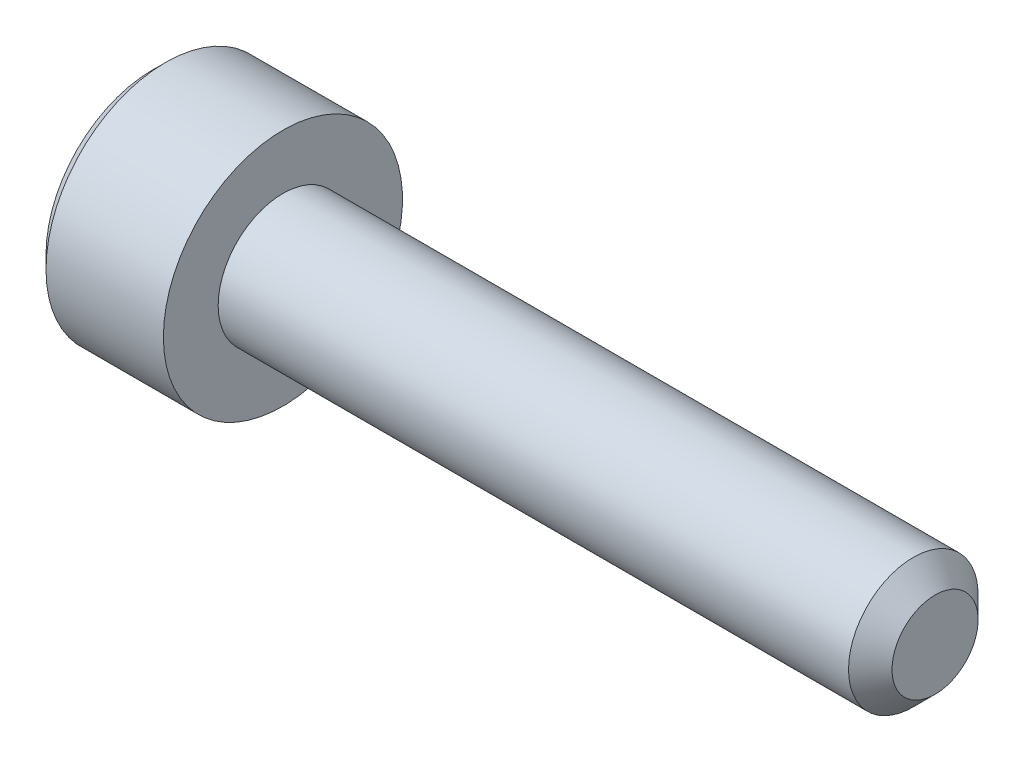
ISO-10303-21;
HEADER;
FILE_DESCRIPTION(('STEP AP214'),'2;1');
FILE_NAME('part.step','',(''),(''),'','','');
FILE_SCHEMA(('AUTOMOTIVE_DESIGN { 1 0 10303 214 1 1 1 1 }'));
ENDSEC;
DATA;
#1=APPLICATION_CONTEXT('core data for automotive mechanical design processes');
#2=APPLICATION_PROTOCOL_DEFINITION('international standard','automotive_design',2000,#1);
#3=PRODUCT_CONTEXT('',#1,'mechanical');
#4=PRODUCT('Part','Part','',(#3));
#5=PRODUCT_RELATED_PRODUCT_CATEGORY('part','',(#4));
#6=PRODUCT_DEFINITION_FORMATION('','',#4);
#7=PRODUCT_DEFINITION_CONTEXT('part definition',#1,'design');
#8=PRODUCT_DEFINITION('design','',#6,#7);
#9=PRODUCT_DEFINITION_SHAPE('','',#8);
#10=(LENGTH_UNIT() NAMED_UNIT(*) SI_UNIT(.MILLI.,.METRE.));
#11=(NAMED_UNIT(*) PLANE_ANGLE_UNIT() SI_UNIT($,.RADIAN.));
#12=(NAMED_UNIT(*) SI_UNIT($,.STERADIAN.) SOLID_ANGLE_UNIT());
#13=UNCERTAINTY_MEASURE_WITH_UNIT(LENGTH_MEASURE(1.E-05),#10,'distance_accuracy_value','');
#14=(GEOMETRIC_REPRESENTATION_CONTEXT(3) GLOBAL_UNCERTAINTY_ASSIGNED_CONTEXT((#13)) GLOBAL_UNIT_ASSIGNED_CONTEXT((#10,
#11,#12)) REPRESENTATION_CONTEXT('',''));
#15=CARTESIAN_POINT('',(0.,0.,0.));
#16=DIRECTION('',(0.,0.,1.));
#17=DIRECTION('',(1.,0.,0.));
#18=AXIS2_PLACEMENT_3D('',#15,#16,#17);
#19=CARTESIAN_POINT('',(0.,0.,0.));
#20=DIRECTION('',(1.,0.,0.));
#21=DIRECTION('',(0.,0.,-1.));
#22=AXIS2_PLACEMENT_3D('',#19,#20,#21);
#23=PLANE('',#22);
#24=DIRECTION('',(0.,0.866025403784439,0.5));
#25=VECTOR('',#24,1.);
#26=CARTESIAN_POINT('',(0.,1.4,-0.981495457622362));
#27=LINE('',#26,#25);
#28=CARTESIAN_POINT('',(0.,0.,-1.78978583448784));
#29=VERTEX_POINT('',#28);
#30=CARTESIAN_POINT('',(0.,1.55,-0.894892917243918));
#31=VERTEX_POINT('',#30);
#32=EDGE_CURVE('E171',#29,#31,#27,.T.);
#33=ORIENTED_EDGE('',*,*,#32,.T.);
#34=DIRECTION('',(0.,0.,1.));
#35=VECTOR('',#34,1.);
#36=CARTESIAN_POINT('',(0.,1.55,0.721687836487032));
#37=LINE('',#36,#35);
#38=CARTESIAN_POINT('',(0.,1.55,0.894892917243919));
#39=VERTEX_POINT('',#38);
#40=EDGE_CURVE('E186',#31,#39,#37,.T.);
#41=ORIENTED_EDGE('',*,*,#40,.T.);
#42=DIRECTION('',(0.,-0.866025403784439,0.5));
#43=VECTOR('',#42,1.);
#44=CARTESIAN_POINT('',(0.,0.15,1.7031832941094));
#45=LINE('',#44,#43);
#46=CARTESIAN_POINT('',(0.,0.,1.78978583448784));
#47=VERTEX_POINT('',#46);
#48=EDGE_CURVE('E183',#39,#47,#45,.T.);
#49=ORIENTED_EDGE('',*,*,#48,.T.);
#50=DIRECTION('',(0.,-0.866025403784439,-0.5));
#51=VECTOR('',#50,1.);
#52=CARTESIAN_POINT('',(0.,-1.4,0.981495457622364));
#53=LINE('',#52,#51);
#54=CARTESIAN_POINT('',(0.,-1.55,0.89489291724392));
#55=VERTEX_POINT('',#54);
#56=EDGE_CURVE('E180',#47,#55,#53,.T.);
#57=ORIENTED_EDGE('',*,*,#56,.T.);
#58=DIRECTION('',(0.,0.,-1.));
#59=VECTOR('',#58,1.);
#60=CARTESIAN_POINT('',(0.,-1.55,-0.721687836487031));
#61=LINE('',#60,#59);
#62=CARTESIAN_POINT('',(0.,-1.55,-0.894892917243919));
#63=VERTEX_POINT('',#62);
#64=EDGE_CURVE('E177',#55,#63,#61,.T.);
#65=ORIENTED_EDGE('',*,*,#64,.T.);
#66=DIRECTION('',(0.,0.866025403784439,-0.5));
#67=VECTOR('',#66,1.);
#68=CARTESIAN_POINT('',(0.,-0.149999999999999,-1.7031832941094));
#69=LINE('',#68,#67);
#70=EDGE_CURVE('E174',#63,#29,#69,.T.);
#71=ORIENTED_EDGE('',*,*,#70,.T.);
#72=EDGE_LOOP('',(#33,#41,#49,#57,#65,#71));
#73=FACE_BOUND('',#72,.T.);
#74=CARTESIAN_POINT('',(0.,0.,0.));
#75=DIRECTION('',(1.,0.,0.));
#76=DIRECTION('',(0.,0.,-1.));
#77=AXIS2_PLACEMENT_3D('',#74,#75,#76);
#78=CIRCLE('',#77,2.45);
#79=CARTESIAN_POINT('',(0.,0.,-2.45));
#80=VERTEX_POINT('',#79);
#81=EDGE_CURVE('E163',#80,#80,#78,.F.);
#82=ORIENTED_EDGE('',*,*,#81,.T.);
#83=EDGE_LOOP('',(#82));
#84=FACE_BOUND('',#83,.T.);
#85=ADVANCED_FACE('F39',(#73,#84),#23,.F.);
#86=CARTESIAN_POINT('',(18.,0.,0.));
#87=DIRECTION('',(-1.,0.,0.));
#88=DIRECTION('',(0.,0.,1.));
#89=AXIS2_PLACEMENT_3D('',#86,#87,#88);
#90=PLANE('',#89);
#91=CARTESIAN_POINT('',(18.,0.,0.));
#92=DIRECTION('',(-1.,0.,0.));
#93=DIRECTION('',(0.,0.,1.));
#94=AXIS2_PLACEMENT_3D('',#91,#92,#93);
#95=CIRCLE('',#94,0.990000000000003);
#96=CARTESIAN_POINT('',(18.,0.,0.990000000000003));
#97=VERTEX_POINT('',#96);
#98=EDGE_CURVE('E159',#97,#97,#95,.F.);
#99=ORIENTED_EDGE('',*,*,#98,.T.);
#100=EDGE_LOOP('',(#99));
#101=FACE_BOUND('',#100,.T.);
#102=ADVANCED_FACE('F286',(#101),#90,.F.);
#103=CARTESIAN_POINT('',(-88.7054908485857,0.,0.));
#104=DIRECTION('',(-1.,0.,0.));
#105=DIRECTION('',(0.,0.,1.));
#106=AXIS2_PLACEMENT_3D('',#103,#104,#105);
#107=CYLINDRICAL_SURFACE('',#106,1.49);
#108=CARTESIAN_POINT('',(17.5,0.,0.));
#109=DIRECTION('',(-1.,0.,0.));
#110=DIRECTION('',(0.,0.,1.));
#111=AXIS2_PLACEMENT_3D('',#108,#109,#110);
#112=CIRCLE('',#111,1.49);
#113=CARTESIAN_POINT('',(17.5,0.,1.49));
#114=VERTEX_POINT('',#113);
#115=EDGE_CURVE('E155',#114,#114,#112,.T.);
#116=ORIENTED_EDGE('',*,*,#115,.T.);
#117=EDGE_LOOP('',(#116));
#118=FACE_BOUND('',#117,.T.);
#119=CARTESIAN_POINT('',(3.,0.,0.));
#120=DIRECTION('',(-1.,0.,0.));
#121=DIRECTION('',(0.,0.,1.));
#122=AXIS2_PLACEMENT_3D('',#119,#120,#121);
#123=CIRCLE('',#122,1.49);
#124=CARTESIAN_POINT('',(3.,0.,1.49));
#125=VERTEX_POINT('',#124);
#126=EDGE_CURVE('E146',#125,#125,#123,.T.);
#127=ORIENTED_EDGE('',*,*,#126,.F.);
#128=EDGE_LOOP('',(#127));
#129=FACE_BOUND('',#128,.T.);
#130=ADVANCED_FACE('F291',(#118,#129),#107,.T.);
#131=CARTESIAN_POINT('',(3.,1.49,0.));
#132=DIRECTION('',(-1.,0.,0.));
#133=DIRECTION('',(0.,0.,1.));
#134=AXIS2_PLACEMENT_3D('',#131,#132,#133);
#135=PLANE('',#134);
#136=CARTESIAN_POINT('',(3.,0.,0.));
#137=DIRECTION('',(-1.,0.,0.));
#138=DIRECTION('',(0.,0.,1.));
#139=AXIS2_PLACEMENT_3D('',#136,#137,#138);
#140=CIRCLE('',#139,2.75);
#141=CARTESIAN_POINT('',(3.,0.,2.75));
#142=VERTEX_POINT('',#141);
#143=EDGE_CURVE('E140',#142,#142,#140,.T.);
#144=ORIENTED_EDGE('',*,*,#143,.F.);
#145=EDGE_LOOP('',(#144));
#146=FACE_BOUND('',#145,.T.);
#147=ORIENTED_EDGE('',*,*,#126,.T.);
#148=EDGE_LOOP('',(#147));
#149=FACE_BOUND('',#148,.T.);
#150=ADVANCED_FACE('F301',(#146,#149),#135,.F.);
#151=CARTESIAN_POINT('',(-88.7054908485857,0.,0.));
#152=DIRECTION('',(-1.,0.,0.));
#153=DIRECTION('',(0.,0.,1.));
#154=AXIS2_PLACEMENT_3D('',#151,#152,#153);
#155=CYLINDRICAL_SURFACE('',#154,2.75);
#156=CARTESIAN_POINT('',(0.299999999999995,0.,0.));
#157=DIRECTION('',(1.,0.,0.));
#158=DIRECTION('',(0.,0.,-1.));
#159=AXIS2_PLACEMENT_3D('',#156,#157,#158);
#160=CIRCLE('',#159,2.75);
#161=CARTESIAN_POINT('',(0.299999999999995,0.,-2.75));
#162=VERTEX_POINT('',#161);
#163=EDGE_CURVE('E167',#162,#162,#160,.T.);
#164=ORIENTED_EDGE('',*,*,#163,.T.);
#165=EDGE_LOOP('',(#164));
#166=FACE_BOUND('',#165,.T.);
#167=ORIENTED_EDGE('',*,*,#143,.T.);
#168=EDGE_LOOP('',(#167));
#169=FACE_BOUND('',#168,.T.);
#170=ADVANCED_FACE('F297',(#166,#169),#155,.T.);
#171=CARTESIAN_POINT('',(17.5,0.,0.));
#172=DIRECTION('',(-1.,0.,0.));
#173=DIRECTION('',(0.,0.,1.));
#174=AXIS2_PLACEMENT_3D('',#171,#172,#173);
#175=CONICAL_SURFACE('',#174,1.49,0.78539816339746);
#176=ORIENTED_EDGE('',*,*,#98,.F.);
#177=EDGE_LOOP('',(#176));
#178=FACE_BOUND('',#177,.T.);
#179=ORIENTED_EDGE('',*,*,#115,.F.);
#180=EDGE_LOOP('',(#179));
#181=FACE_BOUND('',#180,.T.);
#182=ADVANCED_FACE('F300',(#178,#181),#175,.T.);
#183=CARTESIAN_POINT('',(0.,0.,0.));
#184=DIRECTION('',(1.,0.,0.));
#185=DIRECTION('',(0.,0.,-1.));
#186=AXIS2_PLACEMENT_3D('',#183,#184,#185);
#187=CONICAL_SURFACE('',#186,2.45,0.785398163397461);
#188=ORIENTED_EDGE('',*,*,#163,.F.);
#189=EDGE_LOOP('',(#188));
#190=FACE_BOUND('',#189,.T.);
#191=ORIENTED_EDGE('',*,*,#81,.F.);
#192=EDGE_LOOP('',(#191));
#193=FACE_BOUND('',#192,.T.);
#194=ADVANCED_FACE('F311',(#190,#193),#187,.T.);
#195=CARTESIAN_POINT('',(2.5,1.25,0.721687836487032));
#196=DIRECTION('',(0.,-0.5,-0.866025403784438));
#197=DIRECTION('',(0.,0.866025403784439,-0.5));
#198=AXIS2_PLACEMENT_3D('',#195,#196,#197);
#199=PLANE('',#198);
#200=DIRECTION('',(-1.,0.,0.));
#201=VECTOR('',#200,1.);
#202=CARTESIAN_POINT('',(2.5,0.,1.44337567297407));
#203=LINE('',#202,#201);
#204=CARTESIAN_POINT('',(2.5,0.,1.44337567297407));
#205=VERTEX_POINT('',#204);
#206=CARTESIAN_POINT('',(0.300000000000002,0.,1.44337567297407));
#207=VERTEX_POINT('',#206);
#208=EDGE_CURVE('E130',#205,#207,#203,.T.);
#209=ORIENTED_EDGE('',*,*,#208,.T.);
#210=DIRECTION('',(0.,0.866025403784439,-0.5));
#211=VECTOR('',#210,1.);
#212=CARTESIAN_POINT('',(0.300000000000002,1.25,0.721687836487032));
#213=LINE('',#212,#211);
#214=CARTESIAN_POINT('',(0.300000000000002,1.25,0.721687836487032));
#215=VERTEX_POINT('',#214);
#216=EDGE_CURVE('E194',#207,#215,#213,.T.);
#217=ORIENTED_EDGE('',*,*,#216,.T.);
#218=DIRECTION('',(-1.,0.,0.));
#219=VECTOR('',#218,1.);
#220=CARTESIAN_POINT('',(2.5,1.25,0.721687836487032));
#221=LINE('',#220,#219);
#222=CARTESIAN_POINT('',(2.5,1.25,0.721687836487032));
#223=VERTEX_POINT('',#222);
#224=EDGE_CURVE('E133',#223,#215,#221,.T.);
#225=ORIENTED_EDGE('',*,*,#224,.F.);
#226=DIRECTION('',(0.,-0.866025403784439,0.5));
#227=VECTOR('',#226,1.);
#228=CARTESIAN_POINT('',(2.5,1.25,0.721687836487032));
#229=LINE('',#228,#227);
#230=EDGE_CURVE('E117',#223,#205,#229,.T.);
#231=ORIENTED_EDGE('',*,*,#230,.T.);
#232=EDGE_LOOP('',(#209,#217,#225,#231));
#233=FACE_BOUND('',#232,.T.);
#234=ADVANCED_FACE('F129',(#233),#199,.T.);
#235=CARTESIAN_POINT('',(2.5,0.,1.44337567297407));
#236=DIRECTION('',(0.,0.5,-0.866025403784438));
#237=DIRECTION('',(0.,0.866025403784439,0.5));
#238=AXIS2_PLACEMENT_3D('',#235,#236,#237);
#239=PLANE('',#238);
#240=DIRECTION('',(-1.,0.,0.));
#241=VECTOR('',#240,1.);
#242=CARTESIAN_POINT('',(2.5,-1.25,0.721687836487033));
#243=LINE('',#242,#241);
#244=CARTESIAN_POINT('',(2.5,-1.25,0.721687836487033));
#245=VERTEX_POINT('',#244);
#246=CARTESIAN_POINT('',(0.300000000000002,-1.25,0.721687836487033));
#247=VERTEX_POINT('',#246);
#248=EDGE_CURVE('E141',#245,#247,#243,.T.);
#249=ORIENTED_EDGE('',*,*,#248,.T.);
#250=DIRECTION('',(0.,0.866025403784439,0.5));
#251=VECTOR('',#250,1.);
#252=CARTESIAN_POINT('',(0.300000000000002,0.,1.44337567297407));
#253=LINE('',#252,#251);
#254=EDGE_CURVE('E138',#247,#207,#253,.T.);
#255=ORIENTED_EDGE('',*,*,#254,.T.);
#256=ORIENTED_EDGE('',*,*,#208,.F.);
#257=DIRECTION('',(0.,-0.866025403784439,-0.5));
#258=VECTOR('',#257,1.);
#259=CARTESIAN_POINT('',(2.5,0.,1.44337567297407));
#260=LINE('',#259,#258);
#261=EDGE_CURVE('E113',#205,#245,#260,.T.);
#262=ORIENTED_EDGE('',*,*,#261,.T.);
#263=EDGE_LOOP('',(#249,#255,#256,#262));
#264=FACE_BOUND('',#263,.T.);
#265=ADVANCED_FACE('F136',(#264),#239,.T.);
#266=CARTESIAN_POINT('',(2.5,-1.25,0.721687836487033));
#267=DIRECTION('',(0.,1.,0.));
#268=DIRECTION('',(0.,0.,1.));
#269=AXIS2_PLACEMENT_3D('',#266,#267,#268);
#270=PLANE('',#269);
#271=DIRECTION('',(-1.,0.,0.));
#272=VECTOR('',#271,1.);
#273=CARTESIAN_POINT('',(2.5,-1.25,-0.721687836487031));
#274=LINE('',#273,#272);
#275=CARTESIAN_POINT('',(2.5,-1.25,-0.721687836487031));
#276=VERTEX_POINT('',#275);
#277=CARTESIAN_POINT('',(0.300000000000002,-1.25,-0.721687836487031));
#278=VERTEX_POINT('',#277);
#279=EDGE_CURVE('E148',#276,#278,#274,.T.);
#280=ORIENTED_EDGE('',*,*,#279,.T.);
#281=DIRECTION('',(0.,0.,1.));
#282=VECTOR('',#281,1.);
#283=CARTESIAN_POINT('',(0.300000000000002,-1.25,0.721687836487033));
#284=LINE('',#283,#282);
#285=EDGE_CURVE('E199',#278,#247,#284,.T.);
#286=ORIENTED_EDGE('',*,*,#285,.T.);
#287=ORIENTED_EDGE('',*,*,#248,.F.);
#288=DIRECTION('',(0.,0.,-1.));
#289=VECTOR('',#288,1.);
#290=CARTESIAN_POINT('',(2.5,-1.25,0.721687836487033));
#291=LINE('',#290,#289);
#292=EDGE_CURVE('E119',#245,#276,#291,.T.);
#293=ORIENTED_EDGE('',*,*,#292,.T.);
#294=EDGE_LOOP('',(#280,#286,#287,#293));
#295=FACE_BOUND('',#294,.T.);
#296=ADVANCED_FACE('F234',(#295),#270,.T.);
#297=CARTESIAN_POINT('',(2.5,-1.25,-0.721687836487031));
#298=DIRECTION('',(0.,0.5,0.866025403784439));
#299=DIRECTION('',(0.,-0.866025403784439,0.5));
#300=AXIS2_PLACEMENT_3D('',#297,#298,#299);
#301=PLANE('',#300);
#302=DIRECTION('',(-1.,0.,0.));
#303=VECTOR('',#302,1.);
#304=CARTESIAN_POINT('',(2.5,0.,-1.44337567297406));
#305=LINE('',#304,#303);
#306=CARTESIAN_POINT('',(2.5,0.,-1.44337567297406));
#307=VERTEX_POINT('',#306);
#308=CARTESIAN_POINT('',(0.300000000000002,0.,-1.44337567297406));
#309=VERTEX_POINT('',#308);
#310=EDGE_CURVE('E236',#307,#309,#305,.T.);
#311=ORIENTED_EDGE('',*,*,#310,.T.);
#312=DIRECTION('',(0.,-0.866025403784439,0.5));
#313=VECTOR('',#312,1.);
#314=CARTESIAN_POINT('',(0.300000000000002,-1.25,-0.721687836487031));
#315=LINE('',#314,#313);
#316=EDGE_CURVE('E49',#309,#278,#315,.T.);
#317=ORIENTED_EDGE('',*,*,#316,.T.);
#318=ORIENTED_EDGE('',*,*,#279,.F.);
#319=DIRECTION('',(0.,0.866025403784439,-0.499999999999999));
#320=VECTOR('',#319,1.);
#321=CARTESIAN_POINT('',(2.5,-1.25,-0.721687836487031));
#322=LINE('',#321,#320);
#323=EDGE_CURVE('E251',#276,#307,#322,.T.);
#324=ORIENTED_EDGE('',*,*,#323,.T.);
#325=EDGE_LOOP('',(#311,#317,#318,#324));
#326=FACE_BOUND('',#325,.T.);
#327=ADVANCED_FACE('F255',(#326),#301,.T.);
#328=CARTESIAN_POINT('',(2.5,0.,-1.44337567297406));
#329=DIRECTION('',(0.,-0.5,0.866025403784439));
#330=DIRECTION('',(0.,-0.866025403784439,-0.5));
#331=AXIS2_PLACEMENT_3D('',#328,#329,#330);
#332=PLANE('',#331);
#333=DIRECTION('',(-1.,0.,0.));
#334=VECTOR('',#333,1.);
#335=CARTESIAN_POINT('',(2.5,1.25,-0.72168783648703));
#336=LINE('',#335,#334);
#337=CARTESIAN_POINT('',(2.5,1.25,-0.72168783648703));
#338=VERTEX_POINT('',#337);
#339=CARTESIAN_POINT('',(0.300000000000002,1.25,-0.72168783648703));
#340=VERTEX_POINT('',#339);
#341=EDGE_CURVE('E238',#338,#340,#336,.T.);
#342=ORIENTED_EDGE('',*,*,#341,.T.);
#343=DIRECTION('',(0.,-0.866025403784439,-0.5));
#344=VECTOR('',#343,1.);
#345=CARTESIAN_POINT('',(0.300000000000002,0.,-1.44337567297406));
#346=LINE('',#345,#344);
#347=EDGE_CURVE('E11',#340,#309,#346,.T.);
#348=ORIENTED_EDGE('',*,*,#347,.T.);
#349=ORIENTED_EDGE('',*,*,#310,.F.);
#350=DIRECTION('',(0.,0.866025403784438,0.5));
#351=VECTOR('',#350,1.);
#352=CARTESIAN_POINT('',(2.5,0.,-1.44337567297406));
#353=LINE('',#352,#351);
#354=EDGE_CURVE('E248',#307,#338,#353,.T.);
#355=ORIENTED_EDGE('',*,*,#354,.T.);
#356=EDGE_LOOP('',(#342,#348,#349,#355));
#357=FACE_BOUND('',#356,.T.);
#358=ADVANCED_FACE('F257',(#357),#332,.T.);
#359=CARTESIAN_POINT('',(2.5,1.25,-0.72168783648703));
#360=DIRECTION('',(0.,-1.,0.));
#361=DIRECTION('',(0.,0.,-1.));
#362=AXIS2_PLACEMENT_3D('',#359,#360,#361);
#363=PLANE('',#362);
#364=ORIENTED_EDGE('',*,*,#224,.T.);
#365=DIRECTION('',(0.,0.,-1.));
#366=VECTOR('',#365,1.);
#367=CARTESIAN_POINT('',(0.300000000000002,1.25,-0.72168783648703));
#368=LINE('',#367,#366);
#369=EDGE_CURVE('E190',#215,#340,#368,.T.);
#370=ORIENTED_EDGE('',*,*,#369,.T.);
#371=ORIENTED_EDGE('',*,*,#341,.F.);
#372=DIRECTION('',(0.,0.,1.));
#373=VECTOR('',#372,1.);
#374=CARTESIAN_POINT('',(2.5,1.25,-0.72168783648703));
#375=LINE('',#374,#373);
#376=EDGE_CURVE('E245',#338,#223,#375,.T.);
#377=ORIENTED_EDGE('',*,*,#376,.T.);
#378=EDGE_LOOP('',(#364,#370,#371,#377));
#379=FACE_BOUND('',#378,.T.);
#380=ADVANCED_FACE('F260',(#379),#363,.T.);
#381=CARTESIAN_POINT('',(2.5,0.,0.));
#382=DIRECTION('',(1.,0.,0.));
#383=DIRECTION('',(0.,0.,-1.));
#384=AXIS2_PLACEMENT_3D('',#381,#382,#383);
#385=PLANE('',#384);
#386=ORIENTED_EDGE('',*,*,#230,.F.);
#387=ORIENTED_EDGE('',*,*,#376,.F.);
#388=ORIENTED_EDGE('',*,*,#354,.F.);
#389=ORIENTED_EDGE('',*,*,#323,.F.);
#390=ORIENTED_EDGE('',*,*,#292,.F.);
#391=ORIENTED_EDGE('',*,*,#261,.F.);
#392=EDGE_LOOP('',(#386,#387,#388,#389,#390,#391));
#393=FACE_BOUND('',#392,.T.);
#394=ADVANCED_FACE('F115',(#393),#385,.F.);
#395=CARTESIAN_POINT('',(0.,-1.55,0.));
#396=DIRECTION('',(-0.707106781186546,0.70710678118655,0.));
#397=DIRECTION('',(0.,0.,1.));
#398=AXIS2_PLACEMENT_3D('',#395,#396,#397);
#399=PLANE('',#398);
#400=DIRECTION('',(0.654653670707979,0.654653670707976,-0.377964473009226));
#401=VECTOR('',#400,1.);
#402=CARTESIAN_POINT('',(0.221428571428572,-1.32857142857143,0.767051071923361));
#403=LINE('',#402,#401);
#404=EDGE_CURVE('E217',#247,#55,#403,.F.);
#405=ORIENTED_EDGE('',*,*,#404,.F.);
#406=ORIENTED_EDGE('',*,*,#285,.F.);
#407=DIRECTION('',(0.654653670707979,0.654653670707975,0.377964473009226));
#408=VECTOR('',#407,1.);
#409=CARTESIAN_POINT('',(0.221428571428572,-1.32857142857143,-0.76705107192336));
#410=LINE('',#409,#408);
#411=EDGE_CURVE('E43',#63,#278,#410,.T.);
#412=ORIENTED_EDGE('',*,*,#411,.F.);
#413=ORIENTED_EDGE('',*,*,#64,.F.);
#414=EDGE_LOOP('',(#405,#406,#412,#413));
#415=FACE_BOUND('',#414,.T.);
#416=ADVANCED_FACE('F41',(#415),#399,.T.);
#417=CARTESIAN_POINT('',(0.,-0.774999999999999,-1.34233937586588));
#418=DIRECTION('',(-0.707106781186546,0.353553390593274,0.612372435695797));
#419=DIRECTION('',(0.,-0.866025403784439,0.5));
#420=AXIS2_PLACEMENT_3D('',#417,#418,#419);
#421=PLANE('',#420);
#422=ORIENTED_EDGE('',*,*,#411,.T.);
#423=ORIENTED_EDGE('',*,*,#316,.F.);
#424=DIRECTION('',(0.654653670707979,0.,0.755928946018452));
#425=VECTOR('',#424,1.);
#426=CARTESIAN_POINT('',(0.221428571428571,0.,-1.53410214384672));
#427=LINE('',#426,#425);
#428=EDGE_CURVE('E214',#29,#309,#427,.T.);
#429=ORIENTED_EDGE('',*,*,#428,.F.);
#430=ORIENTED_EDGE('',*,*,#70,.F.);
#431=EDGE_LOOP('',(#422,#423,#429,#430));
#432=FACE_BOUND('',#431,.T.);
#433=ADVANCED_FACE('F228',(#432),#421,.T.);
#434=CARTESIAN_POINT('',(0.,-0.775000000000001,1.34233937586588));
#435=DIRECTION('',(-0.707106781186545,0.353553390593275,-0.612372435695796));
#436=DIRECTION('',(0.,0.866025403784439,0.5));
#437=AXIS2_PLACEMENT_3D('',#434,#435,#436);
#438=PLANE('',#437);
#439=ORIENTED_EDGE('',*,*,#404,.T.);
#440=ORIENTED_EDGE('',*,*,#56,.F.);
#441=DIRECTION('',(0.654653670707979,0.,-0.755928946018452));
#442=VECTOR('',#441,1.);
#443=CARTESIAN_POINT('',(0.221428571428572,0.,1.53410214384672));
#444=LINE('',#443,#442);
#445=EDGE_CURVE('E210',#207,#47,#444,.F.);
#446=ORIENTED_EDGE('',*,*,#445,.F.);
#447=ORIENTED_EDGE('',*,*,#254,.F.);
#448=EDGE_LOOP('',(#439,#440,#446,#447));
#449=FACE_BOUND('',#448,.T.);
#450=ADVANCED_FACE('F277',(#449),#438,.T.);
#451=CARTESIAN_POINT('',(0.,0.775,-1.34233937586588));
#452=DIRECTION('',(-0.707106781186545,-0.353553390593275,0.612372435695796));
#453=DIRECTION('',(0.,-0.866025403784439,-0.5));
#454=AXIS2_PLACEMENT_3D('',#451,#452,#453);
#455=PLANE('',#454);
#456=ORIENTED_EDGE('',*,*,#428,.T.);
#457=ORIENTED_EDGE('',*,*,#347,.F.);
#458=DIRECTION('',(-0.654653670707979,0.654653670707976,-0.377964473009226));
#459=VECTOR('',#458,1.);
#460=CARTESIAN_POINT('',(0.221428571428571,1.32857142857143,-0.767051071923359));
#461=LINE('',#460,#459);
#462=EDGE_CURVE('E207',#31,#340,#461,.F.);
#463=ORIENTED_EDGE('',*,*,#462,.F.);
#464=ORIENTED_EDGE('',*,*,#32,.F.);
#465=EDGE_LOOP('',(#456,#457,#463,#464));
#466=FACE_BOUND('',#465,.T.);
#467=ADVANCED_FACE('F275',(#466),#455,.T.);
#468=CARTESIAN_POINT('',(0.,0.775,1.34233937586588));
#469=DIRECTION('',(-0.707106781186545,-0.353553390593275,-0.612372435695796));
#470=DIRECTION('',(0.,0.866025403784439,-0.5));
#471=AXIS2_PLACEMENT_3D('',#468,#469,#470);
#472=PLANE('',#471);
#473=ORIENTED_EDGE('',*,*,#445,.T.);
#474=ORIENTED_EDGE('',*,*,#48,.F.);
#475=DIRECTION('',(0.654653670707979,-0.654653670707976,-0.377964473009226));
#476=VECTOR('',#475,1.);
#477=CARTESIAN_POINT('',(0.221428571428571,1.32857142857143,0.76705107192336));
#478=LINE('',#477,#476);
#479=EDGE_CURVE('E204',#215,#39,#478,.F.);
#480=ORIENTED_EDGE('',*,*,#479,.F.);
#481=ORIENTED_EDGE('',*,*,#216,.F.);
#482=EDGE_LOOP('',(#473,#474,#480,#481));
#483=FACE_BOUND('',#482,.T.);
#484=ADVANCED_FACE('F270',(#483),#472,.T.);
#485=CARTESIAN_POINT('',(0.,1.55,0.));
#486=DIRECTION('',(-0.707106781186546,-0.70710678118655,0.));
#487=DIRECTION('',(0.,0.,-1.));
#488=AXIS2_PLACEMENT_3D('',#485,#486,#487);
#489=PLANE('',#488);
#490=ORIENTED_EDGE('',*,*,#462,.T.);
#491=ORIENTED_EDGE('',*,*,#369,.F.);
#492=ORIENTED_EDGE('',*,*,#479,.T.);
#493=ORIENTED_EDGE('',*,*,#40,.F.);
#494=EDGE_LOOP('',(#490,#491,#492,#493));
#495=FACE_BOUND('',#494,.T.);
#496=ADVANCED_FACE('F264',(#495),#489,.T.);
#497=CLOSED_SHELL('',(#85,#102,#130,#150,#170,#182,#194,#234,#265,#296,#327,#358,#380,#394,#416,
#433,#450,#467,#484,#496));
#498=MANIFOLD_SOLID_BREP('B2',#497);
#499=ADVANCED_BREP_SHAPE_REPRESENTATION('',(#18,#498),#14);
#500=SHAPE_DEFINITION_REPRESENTATION(#9,#499);
ENDSEC;
END-ISO-10303-21;
